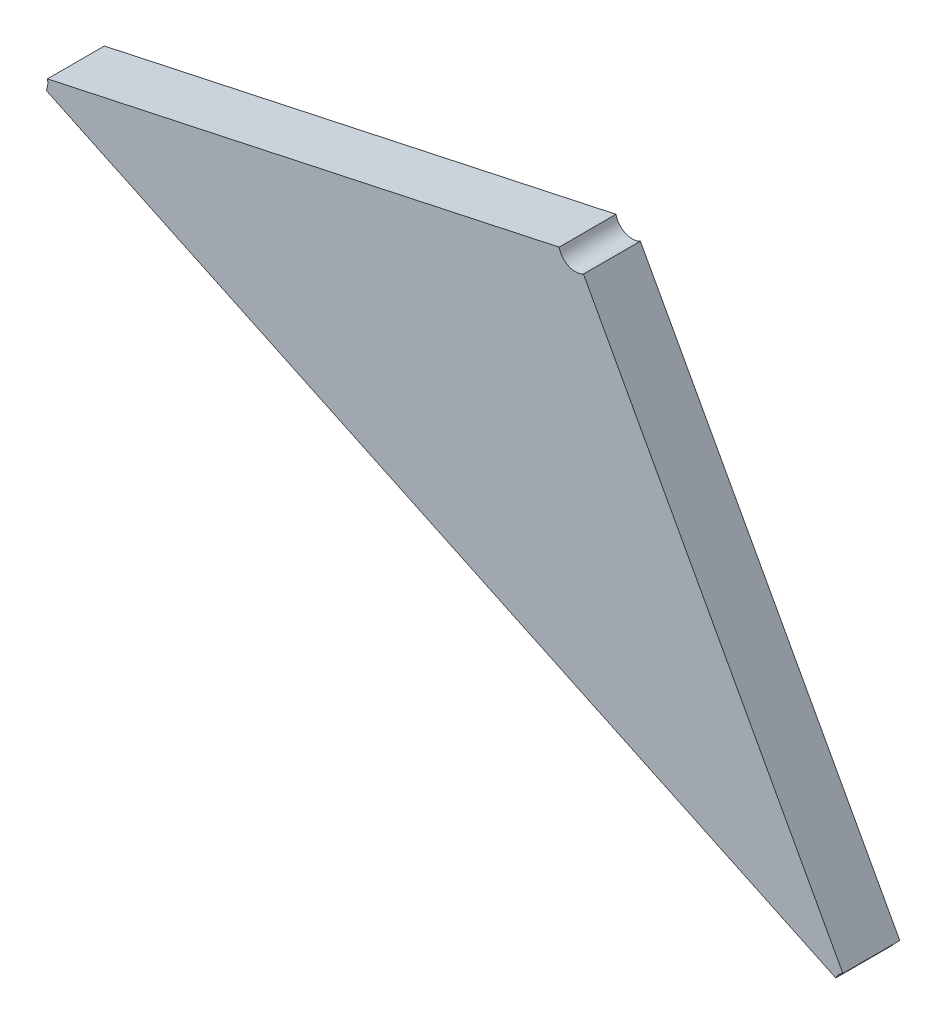
ISO-10303-21;
HEADER;
FILE_DESCRIPTION(('STEP AP214'),'2;1');
FILE_NAME('part.step','',(''),(''),'','','');
FILE_SCHEMA(('AUTOMOTIVE_DESIGN { 1 0 10303 214 1 1 1 1 }'));
ENDSEC;
DATA;
#1=APPLICATION_CONTEXT('core data for automotive mechanical design processes');
#2=APPLICATION_PROTOCOL_DEFINITION('international standard','automotive_design',2000,#1);
#3=PRODUCT_CONTEXT('',#1,'mechanical');
#4=PRODUCT('Part','Part','',(#3));
#5=PRODUCT_RELATED_PRODUCT_CATEGORY('part','',(#4));
#6=PRODUCT_DEFINITION_FORMATION('','',#4);
#7=PRODUCT_DEFINITION_CONTEXT('part definition',#1,'design');
#8=PRODUCT_DEFINITION('design','',#6,#7);
#9=PRODUCT_DEFINITION_SHAPE('','',#8);
#10=(LENGTH_UNIT() NAMED_UNIT(*) SI_UNIT(.MILLI.,.METRE.));
#11=(NAMED_UNIT(*) PLANE_ANGLE_UNIT() SI_UNIT($,.RADIAN.));
#12=(NAMED_UNIT(*) SI_UNIT($,.STERADIAN.) SOLID_ANGLE_UNIT());
#13=UNCERTAINTY_MEASURE_WITH_UNIT(LENGTH_MEASURE(1.E-05),#10,'distance_accuracy_value','');
#14=(GEOMETRIC_REPRESENTATION_CONTEXT(3) GLOBAL_UNCERTAINTY_ASSIGNED_CONTEXT((#13)) GLOBAL_UNIT_ASSIGNED_CONTEXT((#10,
#11,#12)) REPRESENTATION_CONTEXT('',''));
#15=CARTESIAN_POINT('',(0.,0.,0.));
#16=DIRECTION('',(0.,0.,1.));
#17=DIRECTION('',(1.,0.,0.));
#18=AXIS2_PLACEMENT_3D('',#15,#16,#17);
#19=CARTESIAN_POINT('',(-1.31612817168195,-1.36074278433117,0.0042));
#20=DIRECTION('',(0.,0.,1.));
#21=DIRECTION('',(1.,0.,0.));
#22=AXIS2_PLACEMENT_3D('',#19,#20,#21);
#23=PLANE('',#22);
#24=CARTESIAN_POINT('',(-1.29399771700044,-1.37750986813174,0.0042));
#25=DIRECTION('',(0.,0.,-1.));
#26=DIRECTION('',(-0.903806397977017,0.427941578928492,0.));
#27=AXIS2_PLACEMENT_3D('',#24,#25,#26);
#28=CIRCLE('',#27,0.00100000000000001);
#29=CARTESIAN_POINT('',(-1.29490152339842,-1.37708192655281,0.0042));
#30=VERTEX_POINT('',#29);
#31=CARTESIAN_POINT('',(-1.29447630539522,-1.37663182875428,0.0042));
#32=VERTEX_POINT('',#31);
#33=EDGE_CURVE('E11',#30,#32,#28,.T.);
#34=ORIENTED_EDGE('',*,*,#33,.T.);
#35=DIRECTION('',(-0.478588394782365,0.878039377465293,0.));
#36=VECTOR('',#35,1.);
#37=CARTESIAN_POINT('',(-1.29447630539522,-1.37663182875428,0.0042));
#38=LINE('',#37,#36);
#39=CARTESIAN_POINT('',(-1.3099801602625,-1.34818777280894,0.0042));
#40=VERTEX_POINT('',#39);
#41=EDGE_CURVE('E34',#32,#40,#38,.T.);
#42=ORIENTED_EDGE('',*,*,#41,.T.);
#43=CARTESIAN_POINT('',(-1.31045874865729,-1.34730973343148,0.0042));
#44=DIRECTION('',(0.,0.,-1.));
#45=DIRECTION('',(0.478588394790552,-0.87803937746083,0.));
#46=AXIS2_PLACEMENT_3D('',#43,#44,#45);
#47=CIRCLE('',#46,0.001);
#48=CARTESIAN_POINT('',(-1.31143636859726,-1.34752011226353,0.0042));
#49=VERTEX_POINT('',#48);
#50=EDGE_CURVE('E106',#40,#49,#47,.T.);
#51=ORIENTED_EDGE('',*,*,#50,.T.);
#52=DIRECTION('',(-0.977619939969144,-0.210378832050012,0.));
#53=VECTOR('',#52,1.);
#54=CARTESIAN_POINT('',(-1.31143636859726,-1.34752011226353,0.0042));
#55=LINE('',#54,#53);
#56=CARTESIAN_POINT('',(-1.34201573696277,-1.35410063659466,0.0042));
#57=VERTEX_POINT('',#56);
#58=EDGE_CURVE('E68',#49,#57,#55,.T.);
#59=ORIENTED_EDGE('',*,*,#58,.T.);
#60=CARTESIAN_POINT('',(-1.34299335690274,-1.35431101542671,0.0042));
#61=DIRECTION('',(0.,0.,-1.));
#62=DIRECTION('',(0.977619939969193,0.210378832049784,0.));
#63=AXIS2_PLACEMENT_3D('',#60,#61,#62);
#64=CIRCLE('',#63,0.00100000000000002);
#65=CARTESIAN_POINT('',(-1.34208955050476,-1.35473895700564,0.0042));
#66=VERTEX_POINT('',#65);
#67=EDGE_CURVE('E64',#57,#66,#64,.T.);
#68=ORIENTED_EDGE('',*,*,#67,.T.);
#69=DIRECTION('',(0.903806397975919,-0.42794157893081,0.));
#70=VECTOR('',#69,1.);
#71=CARTESIAN_POINT('',(-1.34208955050476,-1.35473895700564,0.0042));
#72=LINE('',#71,#70);
#73=EDGE_CURVE('E66',#66,#30,#72,.T.);
#74=ORIENTED_EDGE('',*,*,#73,.T.);
#75=EDGE_LOOP('',(#34,#42,#51,#59,#68,#74));
#76=FACE_BOUND('',#75,.T.);
#77=ADVANCED_FACE('F17',(#76),#23,.T.);
#78=CARTESIAN_POINT('',(-1.29399771700044,-1.37750986813174,0.0012));
#79=DIRECTION('',(0.,0.,1.));
#80=DIRECTION('',(-1.,0.,0.));
#81=AXIS2_PLACEMENT_3D('',#78,#79,#80);
#82=CYLINDRICAL_SURFACE('',#81,0.00100000000000001);
#83=DIRECTION('',(0.,0.,-1.));
#84=VECTOR('',#83,1.);
#85=CARTESIAN_POINT('',(-1.29447630539522,-1.37663182875428,0.0042));
#86=LINE('',#85,#84);
#87=CARTESIAN_POINT('',(-1.29447630539522,-1.37663182875428,0.0008));
#88=VERTEX_POINT('',#87);
#89=EDGE_CURVE('E24',#32,#88,#86,.T.);
#90=ORIENTED_EDGE('',*,*,#89,.F.);
#91=ORIENTED_EDGE('',*,*,#33,.F.);
#92=DIRECTION('',(0.,0.,1.));
#93=VECTOR('',#92,1.);
#94=CARTESIAN_POINT('',(-1.29490152339842,-1.37708192655281,0.0008));
#95=LINE('',#94,#93);
#96=CARTESIAN_POINT('',(-1.29490152339842,-1.37708192655281,0.0008));
#97=VERTEX_POINT('',#96);
#98=EDGE_CURVE('E81',#97,#30,#95,.T.);
#99=ORIENTED_EDGE('',*,*,#98,.F.);
#100=CARTESIAN_POINT('',(-1.29399771700044,-1.37750986813174,0.0008));
#101=DIRECTION('',(0.,0.,1.));
#102=DIRECTION('',(-0.478588394782881,0.878039377465012,0.));
#103=AXIS2_PLACEMENT_3D('',#100,#101,#102);
#104=CIRCLE('',#103,0.00100000000000001);
#105=EDGE_CURVE('E72',#88,#97,#104,.T.);
#106=ORIENTED_EDGE('',*,*,#105,.F.);
#107=EDGE_LOOP('',(#90,#91,#99,#106));
#108=FACE_BOUND('',#107,.T.);
#109=ADVANCED_FACE('F128',(#108),#82,.F.);
#110=CARTESIAN_POINT('',(-1.31045874865729,-1.34730973343148,0.0012));
#111=DIRECTION('',(0.,0.,1.));
#112=DIRECTION('',(-1.,0.,0.));
#113=AXIS2_PLACEMENT_3D('',#110,#111,#112);
#114=CYLINDRICAL_SURFACE('',#113,0.001);
#115=DIRECTION('',(0.,-1.30614473485313E-13,1.));
#116=VECTOR('',#115,1.);
#117=CARTESIAN_POINT('',(-1.3099801602625,-1.34818777280894,0.0008));
#118=LINE('',#117,#116);
#119=CARTESIAN_POINT('',(-1.3099801602625,-1.34818777280894,0.0008));
#120=VERTEX_POINT('',#119);
#121=EDGE_CURVE('E108',#120,#40,#118,.T.);
#122=ORIENTED_EDGE('',*,*,#121,.F.);
#123=CARTESIAN_POINT('',(-1.31045874865729,-1.34730973343148,0.0008));
#124=DIRECTION('',(0.,0.,1.));
#125=DIRECTION('',(-0.977619939969193,-0.210378832049784,0.));
#126=AXIS2_PLACEMENT_3D('',#123,#124,#125);
#127=CIRCLE('',#126,0.001);
#128=CARTESIAN_POINT('',(-1.31143636859726,-1.34752011226353,0.0008));
#129=VERTEX_POINT('',#128);
#130=EDGE_CURVE('E101',#129,#120,#127,.T.);
#131=ORIENTED_EDGE('',*,*,#130,.F.);
#132=DIRECTION('',(0.,0.,-1.));
#133=VECTOR('',#132,1.);
#134=CARTESIAN_POINT('',(-1.31143636859726,-1.34752011226353,0.0042));
#135=LINE('',#134,#133);
#136=EDGE_CURVE('E95',#49,#129,#135,.T.);
#137=ORIENTED_EDGE('',*,*,#136,.F.);
#138=ORIENTED_EDGE('',*,*,#50,.F.);
#139=EDGE_LOOP('',(#122,#131,#137,#138));
#140=FACE_BOUND('',#139,.T.);
#141=ADVANCED_FACE('F126',(#140),#114,.F.);
#142=CARTESIAN_POINT('',(-1.34299335690274,-1.35431101542671,0.0012));
#143=DIRECTION('',(0.,0.,1.));
#144=DIRECTION('',(0.993380341584751,-0.114871654262327,0.));
#145=AXIS2_PLACEMENT_3D('',#142,#143,#144);
#146=CYLINDRICAL_SURFACE('',#145,0.00100000000000002);
#147=DIRECTION('',(0.,0.,1.));
#148=VECTOR('',#147,1.);
#149=CARTESIAN_POINT('',(-1.34201573696277,-1.35410063659466,0.0008));
#150=LINE('',#149,#148);
#151=CARTESIAN_POINT('',(-1.34201573696277,-1.35410063659466,0.0008));
#152=VERTEX_POINT('',#151);
#153=EDGE_CURVE('E104',#152,#57,#150,.T.);
#154=ORIENTED_EDGE('',*,*,#153,.F.);
#155=CARTESIAN_POINT('',(-1.34299335690274,-1.35431101542671,0.0008));
#156=DIRECTION('',(0.,0.,1.));
#157=DIRECTION('',(0.903806397976976,-0.427941578928578,0.));
#158=AXIS2_PLACEMENT_3D('',#155,#156,#157);
#159=CIRCLE('',#158,0.00100000000000002);
#160=CARTESIAN_POINT('',(-1.34208955050476,-1.35473895700564,0.0008));
#161=VERTEX_POINT('',#160);
#162=EDGE_CURVE('E85',#161,#152,#159,.T.);
#163=ORIENTED_EDGE('',*,*,#162,.F.);
#164=DIRECTION('',(0.,0.,-1.));
#165=VECTOR('',#164,1.);
#166=CARTESIAN_POINT('',(-1.34208955050476,-1.35473895700564,0.0042));
#167=LINE('',#166,#165);
#168=EDGE_CURVE('E79',#66,#161,#167,.T.);
#169=ORIENTED_EDGE('',*,*,#168,.F.);
#170=ORIENTED_EDGE('',*,*,#67,.F.);
#171=EDGE_LOOP('',(#154,#163,#169,#170));
#172=FACE_BOUND('',#171,.T.);
#173=ADVANCED_FACE('F83',(#172),#146,.F.);
#174=CARTESIAN_POINT('',(-1.34299335690274,-1.35431101542671,0.0008));
#175=DIRECTION('',(-0.427941578930813,-0.903806397975918,0.));
#176=DIRECTION('',(0.903806397975918,-0.427941578930813,0.));
#177=AXIS2_PLACEMENT_3D('',#174,#175,#176);
#178=PLANE('',#177);
#179=ORIENTED_EDGE('',*,*,#98,.T.);
#180=ORIENTED_EDGE('',*,*,#73,.F.);
#181=ORIENTED_EDGE('',*,*,#168,.T.);
#182=DIRECTION('',(0.903806397975919,-0.427941578930811,0.));
#183=VECTOR('',#182,1.);
#184=CARTESIAN_POINT('',(-1.34208955050476,-1.35473895700564,0.0008));
#185=LINE('',#184,#183);
#186=EDGE_CURVE('E120',#161,#97,#185,.T.);
#187=ORIENTED_EDGE('',*,*,#186,.T.);
#188=EDGE_LOOP('',(#179,#180,#181,#187));
#189=FACE_BOUND('',#188,.T.);
#190=ADVANCED_FACE('F77',(#189),#178,.T.);
#191=CARTESIAN_POINT('',(-1.31045874865729,-1.34730973343148,0.0008));
#192=DIRECTION('',(-0.210378832050013,0.977619939969144,0.));
#193=DIRECTION('',(-0.977619939969144,-0.210378832050013,0.));
#194=AXIS2_PLACEMENT_3D('',#191,#192,#193);
#195=PLANE('',#194);
#196=ORIENTED_EDGE('',*,*,#136,.T.);
#197=DIRECTION('',(-0.977619939969145,-0.210378832050006,0.));
#198=VECTOR('',#197,1.);
#199=CARTESIAN_POINT('',(-1.31143636859726,-1.34752011226353,0.0008));
#200=LINE('',#199,#198);
#201=EDGE_CURVE('E86',#129,#152,#200,.T.);
#202=ORIENTED_EDGE('',*,*,#201,.T.);
#203=ORIENTED_EDGE('',*,*,#153,.T.);
#204=ORIENTED_EDGE('',*,*,#58,.F.);
#205=EDGE_LOOP('',(#196,#202,#203,#204));
#206=FACE_BOUND('',#205,.T.);
#207=ADVANCED_FACE('F123',(#206),#195,.T.);
#208=CARTESIAN_POINT('',(-1.29399771700044,-1.37750986813174,0.0008));
#209=DIRECTION('',(0.878039377465294,0.478588394782364,0.));
#210=DIRECTION('',(-0.478588394782364,0.878039377465294,0.));
#211=AXIS2_PLACEMENT_3D('',#208,#209,#210);
#212=PLANE('',#211);
#213=ORIENTED_EDGE('',*,*,#89,.T.);
#214=DIRECTION('',(-0.478588394782368,0.878039377465291,0.));
#215=VECTOR('',#214,1.);
#216=CARTESIAN_POINT('',(-1.29447630539522,-1.37663182875428,0.0008));
#217=LINE('',#216,#215);
#218=EDGE_CURVE('E89',#88,#120,#217,.T.);
#219=ORIENTED_EDGE('',*,*,#218,.T.);
#220=ORIENTED_EDGE('',*,*,#121,.T.);
#221=ORIENTED_EDGE('',*,*,#41,.F.);
#222=EDGE_LOOP('',(#213,#219,#220,#221));
#223=FACE_BOUND('',#222,.T.);
#224=ADVANCED_FACE('F115',(#223),#212,.T.);
#225=CARTESIAN_POINT('',(-1.31615228362084,-1.36079966347413,0.0008));
#226=DIRECTION('',(0.,0.,1.));
#227=DIRECTION('',(1.,0.,0.));
#228=AXIS2_PLACEMENT_3D('',#225,#226,#227);
#229=PLANE('',#228);
#230=ORIENTED_EDGE('',*,*,#105,.T.);
#231=ORIENTED_EDGE('',*,*,#186,.F.);
#232=ORIENTED_EDGE('',*,*,#162,.T.);
#233=ORIENTED_EDGE('',*,*,#201,.F.);
#234=ORIENTED_EDGE('',*,*,#130,.T.);
#235=ORIENTED_EDGE('',*,*,#218,.F.);
#236=EDGE_LOOP('',(#230,#231,#232,#233,#234,#235));
#237=FACE_BOUND('',#236,.T.);
#238=ADVANCED_FACE('F118',(#237),#229,.F.);
#239=CLOSED_SHELL('',(#77,#109,#141,#173,#190,#207,#224,#238));
#240=MANIFOLD_SOLID_BREP('B1',#239);
#241=ADVANCED_BREP_SHAPE_REPRESENTATION('',(#18,#240),#14);
#242=SHAPE_DEFINITION_REPRESENTATION(#9,#241);
ENDSEC;
END-ISO-10303-21;
